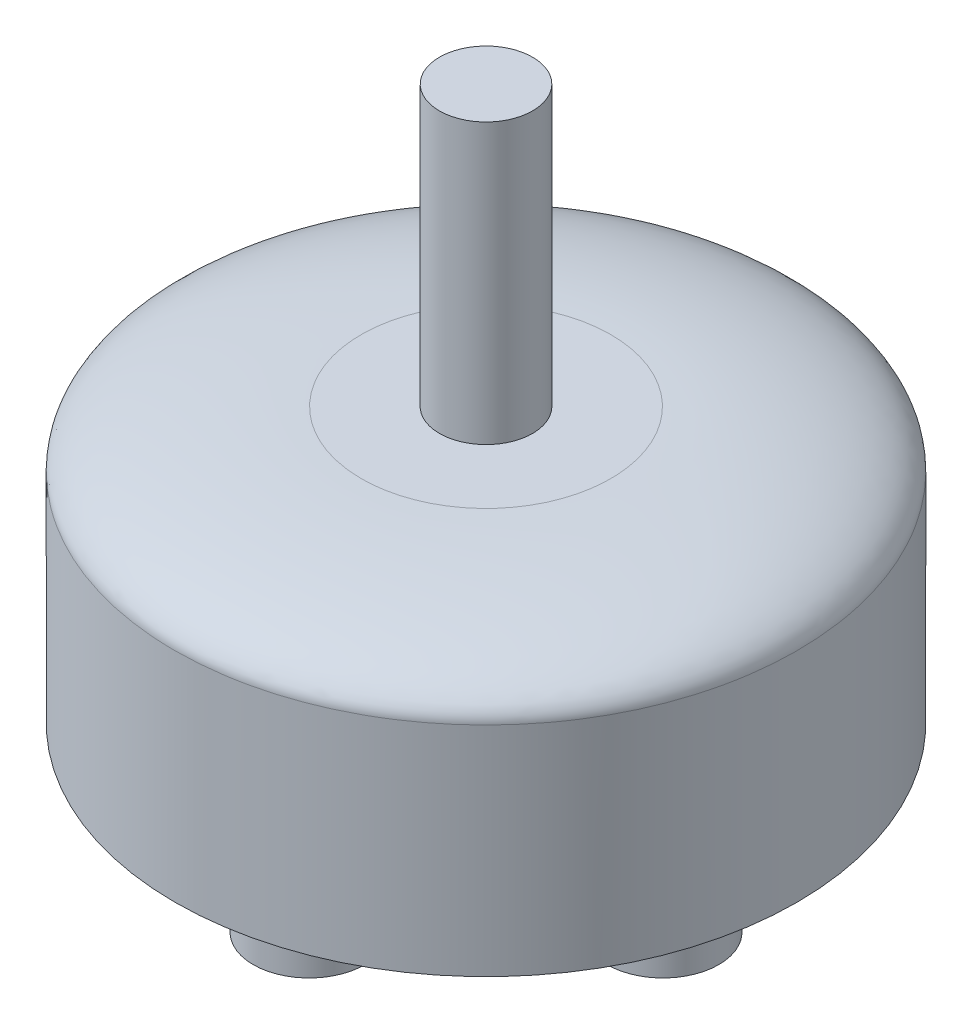
ISO-10303-21;
HEADER;
FILE_DESCRIPTION(('STEP AP214'),'2;1');
FILE_NAME('part.step','',(''),(''),'','','');
FILE_SCHEMA(('AUTOMOTIVE_DESIGN { 1 0 10303 214 1 1 1 1 }'));
ENDSEC;
DATA;
#1=APPLICATION_CONTEXT('core data for automotive mechanical design processes');
#2=APPLICATION_PROTOCOL_DEFINITION('international standard','automotive_design',2000,#1);
#3=PRODUCT_CONTEXT('',#1,'mechanical');
#4=PRODUCT('Part','Part','',(#3));
#5=PRODUCT_RELATED_PRODUCT_CATEGORY('part','',(#4));
#6=PRODUCT_DEFINITION_FORMATION('','',#4);
#7=PRODUCT_DEFINITION_CONTEXT('part definition',#1,'design');
#8=PRODUCT_DEFINITION('design','',#6,#7);
#9=PRODUCT_DEFINITION_SHAPE('','',#8);
#10=(LENGTH_UNIT() NAMED_UNIT(*) SI_UNIT(.MILLI.,.METRE.));
#11=(NAMED_UNIT(*) PLANE_ANGLE_UNIT() SI_UNIT($,.RADIAN.));
#12=(NAMED_UNIT(*) SI_UNIT($,.STERADIAN.) SOLID_ANGLE_UNIT());
#13=UNCERTAINTY_MEASURE_WITH_UNIT(LENGTH_MEASURE(1.E-05),#10,'distance_accuracy_value','');
#14=(GEOMETRIC_REPRESENTATION_CONTEXT(3) GLOBAL_UNCERTAINTY_ASSIGNED_CONTEXT((#13)) GLOBAL_UNIT_ASSIGNED_CONTEXT((#10,
#11,#12)) REPRESENTATION_CONTEXT('',''));
#15=CARTESIAN_POINT('',(0.,0.,0.));
#16=DIRECTION('',(0.,0.,1.));
#17=DIRECTION('',(1.,0.,0.));
#18=AXIS2_PLACEMENT_3D('',#15,#16,#17);
#19=CARTESIAN_POINT('',(-4.74999999999986,3.,1.34135758056431E-13));
#20=DIRECTION('',(0.,1.,0.));
#21=DIRECTION('',(0.,0.,1.));
#22=AXIS2_PLACEMENT_3D('',#19,#20,#21);
#23=PLANE('',#22);
#24=CARTESIAN_POINT('',(0.,3.,9.5));
#25=DIRECTION('',(0.,1.,0.));
#26=DIRECTION('',(0.,0.,1.));
#27=AXIS2_PLACEMENT_3D('',#24,#25,#26);
#28=CIRCLE('',#27,1.50000000000077);
#29=CARTESIAN_POINT('',(0.,3.,11.0000000000008));
#30=VERTEX_POINT('',#29);
#31=EDGE_CURVE('E259',#30,#30,#28,.T.);
#32=ORIENTED_EDGE('',*,*,#31,.F.);
#33=EDGE_LOOP('',(#32));
#34=FACE_BOUND('',#33,.T.);
#35=CARTESIAN_POINT('',(0.,3.,-9.5));
#36=DIRECTION('',(0.,1.,0.));
#37=DIRECTION('',(0.,0.,1.));
#38=AXIS2_PLACEMENT_3D('',#35,#36,#37);
#39=CIRCLE('',#38,1.5);
#40=CARTESIAN_POINT('',(0.,3.,-8.));
#41=VERTEX_POINT('',#40);
#42=EDGE_CURVE('E149',#41,#41,#39,.T.);
#43=ORIENTED_EDGE('',*,*,#42,.F.);
#44=EDGE_LOOP('',(#43));
#45=FACE_BOUND('',#44,.T.);
#46=CARTESIAN_POINT('',(0.,3.,0.));
#47=DIRECTION('',(0.,1.,0.));
#48=DIRECTION('',(0.,0.,1.));
#49=AXIS2_PLACEMENT_3D('',#46,#47,#48);
#50=CIRCLE('',#49,9.5);
#51=CARTESIAN_POINT('',(-2.96236784830953,3.,-9.02631578947369));
#52=VERTEX_POINT('',#51);
#53=CARTESIAN_POINT('',(-9.02631578947375,3.,-2.96236784830932));
#54=VERTEX_POINT('',#53);
#55=EDGE_CURVE('E160',#52,#54,#50,.T.);
#56=ORIENTED_EDGE('',*,*,#55,.T.);
#57=CARTESIAN_POINT('',(-9.49999999999973,3.,2.68271516112861E-13));
#58=DIRECTION('',(0.,1.,0.));
#59=DIRECTION('',(0.,0.,1.));
#60=AXIS2_PLACEMENT_3D('',#57,#58,#59);
#61=CIRCLE('',#60,3.);
#62=CARTESIAN_POINT('',(-9.02631578947359,3.,2.96236784830983));
#63=VERTEX_POINT('',#62);
#64=EDGE_CURVE('E108',#54,#63,#61,.T.);
#65=ORIENTED_EDGE('',*,*,#64,.T.);
#66=CARTESIAN_POINT('',(0.,3.,0.));
#67=DIRECTION('',(0.,1.,0.));
#68=DIRECTION('',(0.,0.,1.));
#69=AXIS2_PLACEMENT_3D('',#66,#67,#68);
#70=CIRCLE('',#69,9.5);
#71=CARTESIAN_POINT('',(-2.96236784830903,3.,9.02631578947385));
#72=VERTEX_POINT('',#71);
#73=EDGE_CURVE('E277',#63,#72,#70,.T.);
#74=ORIENTED_EDGE('',*,*,#73,.T.);
#75=CARTESIAN_POINT('',(5.37685650259296E-13,3.,9.5));
#76=DIRECTION('',(0.,1.,0.));
#77=DIRECTION('',(0.,0.,1.));
#78=AXIS2_PLACEMENT_3D('',#75,#76,#77);
#79=CIRCLE('',#78,3.);
#80=CARTESIAN_POINT('',(2.96236784831005,3.,9.02631578947351));
#81=VERTEX_POINT('',#80);
#82=EDGE_CURVE('E279',#72,#81,#79,.T.);
#83=ORIENTED_EDGE('',*,*,#82,.T.);
#84=CARTESIAN_POINT('',(0.,3.,0.));
#85=DIRECTION('',(0.,1.,0.));
#86=DIRECTION('',(0.,0.,1.));
#87=AXIS2_PLACEMENT_3D('',#84,#85,#86);
#88=CIRCLE('',#87,9.5);
#89=CARTESIAN_POINT('',(9.02631578947371,3.,2.96236784830944));
#90=VERTEX_POINT('',#89);
#91=EDGE_CURVE('E127',#81,#90,#88,.T.);
#92=ORIENTED_EDGE('',*,*,#91,.T.);
#93=CARTESIAN_POINT('',(9.50000000000026,3.,-2.70577548605625E-13));
#94=DIRECTION('',(0.,1.,0.));
#95=DIRECTION('',(0.,0.,1.));
#96=AXIS2_PLACEMENT_3D('',#93,#94,#95);
#97=CIRCLE('',#96,3.00000000000021);
#98=CARTESIAN_POINT('',(9.02631578947354,3.,-2.96236784830996));
#99=VERTEX_POINT('',#98);
#100=EDGE_CURVE('E121',#90,#99,#97,.T.);
#101=ORIENTED_EDGE('',*,*,#100,.T.);
#102=CARTESIAN_POINT('',(0.,3.,0.));
#103=DIRECTION('',(0.,1.,0.));
#104=DIRECTION('',(0.,0.,1.));
#105=AXIS2_PLACEMENT_3D('',#102,#103,#104);
#106=CIRCLE('',#105,9.5);
#107=CARTESIAN_POINT('',(2.96236784830953,3.,-9.02631578947368));
#108=VERTEX_POINT('',#107);
#109=EDGE_CURVE('E125',#99,#108,#106,.T.);
#110=ORIENTED_EDGE('',*,*,#109,.T.);
#111=CARTESIAN_POINT('',(0.,3.,-9.5));
#112=DIRECTION('',(0.,1.,0.));
#113=DIRECTION('',(0.,0.,1.));
#114=AXIS2_PLACEMENT_3D('',#111,#112,#113);
#115=CIRCLE('',#114,3.);
#116=EDGE_CURVE('E64',#108,#52,#115,.T.);
#117=ORIENTED_EDGE('',*,*,#116,.T.);
#118=EDGE_LOOP('',(#56,#65,#74,#83,#92,#101,#110,#117));
#119=FACE_BOUND('',#118,.T.);
#120=CARTESIAN_POINT('',(9.5,3.,0.));
#121=DIRECTION('',(0.,1.,0.));
#122=DIRECTION('',(0.,0.,1.));
#123=AXIS2_PLACEMENT_3D('',#120,#121,#122);
#124=CIRCLE('',#123,1.5000000000005);
#125=CARTESIAN_POINT('',(9.5,3.,1.5000000000005));
#126=VERTEX_POINT('',#125);
#127=EDGE_CURVE('E265',#126,#126,#124,.T.);
#128=ORIENTED_EDGE('',*,*,#127,.F.);
#129=EDGE_LOOP('',(#128));
#130=FACE_BOUND('',#129,.T.);
#131=CARTESIAN_POINT('',(-9.5,3.,0.));
#132=DIRECTION('',(0.,1.,0.));
#133=DIRECTION('',(0.,0.,1.));
#134=AXIS2_PLACEMENT_3D('',#131,#132,#133);
#135=CIRCLE('',#134,1.50000000000027);
#136=CARTESIAN_POINT('',(-9.5,3.,1.50000000000027));
#137=VERTEX_POINT('',#136);
#138=EDGE_CURVE('E253',#137,#137,#135,.T.);
#139=ORIENTED_EDGE('',*,*,#138,.F.);
#140=EDGE_LOOP('',(#139));
#141=FACE_BOUND('',#140,.T.);
#142=CARTESIAN_POINT('',(0.,3.,0.));
#143=DIRECTION('',(0.,1.,0.));
#144=DIRECTION('',(0.,0.,1.));
#145=AXIS2_PLACEMENT_3D('',#142,#143,#144);
#146=CIRCLE('',#145,7.);
#147=CARTESIAN_POINT('',(0.,3.,7.));
#148=VERTEX_POINT('',#147);
#149=EDGE_CURVE('E237',#148,#148,#146,.T.);
#150=ORIENTED_EDGE('',*,*,#149,.F.);
#151=EDGE_LOOP('',(#150));
#152=FACE_BOUND('',#151,.T.);
#153=ADVANCED_FACE('F41',(#34,#45,#119,#130,#141,#152),#23,.T.);
#154=CARTESIAN_POINT('',(-4.74999999999986,0.,1.34135758056431E-13));
#155=DIRECTION('',(0.,1.,0.));
#156=DIRECTION('',(0.,0.,1.));
#157=AXIS2_PLACEMENT_3D('',#154,#155,#156);
#158=PLANE('',#157);
#159=CARTESIAN_POINT('',(0.,0.,0.));
#160=DIRECTION('',(0.,1.,0.));
#161=DIRECTION('',(0.,0.,1.));
#162=AXIS2_PLACEMENT_3D('',#159,#160,#161);
#163=CIRCLE('',#162,9.5);
#164=CARTESIAN_POINT('',(-2.96236784830953,0.,-9.02631578947369));
#165=VERTEX_POINT('',#164);
#166=CARTESIAN_POINT('',(-9.02631578947375,0.,-2.96236784830932));
#167=VERTEX_POINT('',#166);
#168=EDGE_CURVE('E145',#165,#167,#163,.T.);
#169=ORIENTED_EDGE('',*,*,#168,.F.);
#170=CARTESIAN_POINT('',(0.,0.,-9.5));
#171=DIRECTION('',(0.,1.,0.));
#172=DIRECTION('',(0.,0.,1.));
#173=AXIS2_PLACEMENT_3D('',#170,#171,#172);
#174=CIRCLE('',#173,3.);
#175=CARTESIAN_POINT('',(2.96236784830953,0.,-9.02631578947368));
#176=VERTEX_POINT('',#175);
#177=EDGE_CURVE('E99',#176,#165,#174,.T.);
#178=ORIENTED_EDGE('',*,*,#177,.F.);
#179=CARTESIAN_POINT('',(0.,0.,0.));
#180=DIRECTION('',(0.,1.,0.));
#181=DIRECTION('',(0.,0.,1.));
#182=AXIS2_PLACEMENT_3D('',#179,#180,#181);
#183=CIRCLE('',#182,9.5);
#184=CARTESIAN_POINT('',(9.02631578947354,0.,-2.96236784830996));
#185=VERTEX_POINT('',#184);
#186=EDGE_CURVE('E93',#185,#176,#183,.T.);
#187=ORIENTED_EDGE('',*,*,#186,.F.);
#188=CARTESIAN_POINT('',(9.50000000000026,0.,-2.70577548605625E-13));
#189=DIRECTION('',(0.,1.,0.));
#190=DIRECTION('',(0.,0.,1.));
#191=AXIS2_PLACEMENT_3D('',#188,#189,#190);
#192=CIRCLE('',#191,3.00000000000021);
#193=CARTESIAN_POINT('',(9.02631578947371,0.,2.96236784830944));
#194=VERTEX_POINT('',#193);
#195=EDGE_CURVE('E135',#194,#185,#192,.T.);
#196=ORIENTED_EDGE('',*,*,#195,.F.);
#197=CARTESIAN_POINT('',(0.,0.,0.));
#198=DIRECTION('',(0.,1.,0.));
#199=DIRECTION('',(0.,0.,1.));
#200=AXIS2_PLACEMENT_3D('',#197,#198,#199);
#201=CIRCLE('',#200,9.5);
#202=CARTESIAN_POINT('',(2.96236784831005,0.,9.02631578947351));
#203=VERTEX_POINT('',#202);
#204=EDGE_CURVE('E155',#203,#194,#201,.T.);
#205=ORIENTED_EDGE('',*,*,#204,.F.);
#206=CARTESIAN_POINT('',(5.37685650259296E-13,0.,9.5));
#207=DIRECTION('',(0.,1.,0.));
#208=DIRECTION('',(0.,0.,1.));
#209=AXIS2_PLACEMENT_3D('',#206,#207,#208);
#210=CIRCLE('',#209,3.);
#211=CARTESIAN_POINT('',(-2.96236784830903,0.,9.02631578947385));
#212=VERTEX_POINT('',#211);
#213=EDGE_CURVE('E153',#212,#203,#210,.T.);
#214=ORIENTED_EDGE('',*,*,#213,.F.);
#215=CARTESIAN_POINT('',(0.,0.,0.));
#216=DIRECTION('',(0.,1.,0.));
#217=DIRECTION('',(0.,0.,1.));
#218=AXIS2_PLACEMENT_3D('',#215,#216,#217);
#219=CIRCLE('',#218,9.5);
#220=CARTESIAN_POINT('',(-9.02631578947359,0.,2.96236784830983));
#221=VERTEX_POINT('',#220);
#222=EDGE_CURVE('E151',#221,#212,#219,.T.);
#223=ORIENTED_EDGE('',*,*,#222,.F.);
#224=CARTESIAN_POINT('',(-9.49999999999973,0.,2.68271516112861E-13));
#225=DIRECTION('',(0.,1.,0.));
#226=DIRECTION('',(0.,0.,1.));
#227=AXIS2_PLACEMENT_3D('',#224,#225,#226);
#228=CIRCLE('',#227,3.);
#229=EDGE_CURVE('E148',#167,#221,#228,.T.);
#230=ORIENTED_EDGE('',*,*,#229,.F.);
#231=EDGE_LOOP('',(#169,#178,#187,#196,#205,#214,#223,#230));
#232=FACE_BOUND('',#231,.T.);
#233=CARTESIAN_POINT('',(0.,0.,-9.5));
#234=DIRECTION('',(0.,1.,0.));
#235=DIRECTION('',(0.,0.,1.));
#236=AXIS2_PLACEMENT_3D('',#233,#234,#235);
#237=CIRCLE('',#236,1.5);
#238=CARTESIAN_POINT('',(0.,0.,-8.));
#239=VERTEX_POINT('',#238);
#240=EDGE_CURVE('E268',#239,#239,#237,.T.);
#241=ORIENTED_EDGE('',*,*,#240,.T.);
#242=EDGE_LOOP('',(#241));
#243=FACE_BOUND('',#242,.T.);
#244=CARTESIAN_POINT('',(9.5,0.,0.));
#245=DIRECTION('',(0.,1.,0.));
#246=DIRECTION('',(0.,0.,1.));
#247=AXIS2_PLACEMENT_3D('',#244,#245,#246);
#248=CIRCLE('',#247,1.5000000000005);
#249=CARTESIAN_POINT('',(9.5,0.,1.5000000000005));
#250=VERTEX_POINT('',#249);
#251=EDGE_CURVE('E262',#250,#250,#248,.T.);
#252=ORIENTED_EDGE('',*,*,#251,.T.);
#253=EDGE_LOOP('',(#252));
#254=FACE_BOUND('',#253,.T.);
#255=CARTESIAN_POINT('',(0.,0.,9.5));
#256=DIRECTION('',(0.,1.,0.));
#257=DIRECTION('',(0.,0.,1.));
#258=AXIS2_PLACEMENT_3D('',#255,#256,#257);
#259=CIRCLE('',#258,1.50000000000077);
#260=CARTESIAN_POINT('',(0.,0.,11.0000000000008));
#261=VERTEX_POINT('',#260);
#262=EDGE_CURVE('E256',#261,#261,#259,.T.);
#263=ORIENTED_EDGE('',*,*,#262,.T.);
#264=EDGE_LOOP('',(#263));
#265=FACE_BOUND('',#264,.T.);
#266=CARTESIAN_POINT('',(-9.5,0.,0.));
#267=DIRECTION('',(0.,1.,0.));
#268=DIRECTION('',(0.,0.,1.));
#269=AXIS2_PLACEMENT_3D('',#266,#267,#268);
#270=CIRCLE('',#269,1.50000000000027);
#271=CARTESIAN_POINT('',(-9.5,0.,1.50000000000027));
#272=VERTEX_POINT('',#271);
#273=EDGE_CURVE('E252',#272,#272,#270,.T.);
#274=ORIENTED_EDGE('',*,*,#273,.T.);
#275=EDGE_LOOP('',(#274));
#276=FACE_BOUND('',#275,.T.);
#277=CARTESIAN_POINT('',(0.,0.,0.));
#278=DIRECTION('',(0.,1.,0.));
#279=DIRECTION('',(0.,0.,1.));
#280=AXIS2_PLACEMENT_3D('',#277,#278,#279);
#281=CIRCLE('',#280,4.5);
#282=CARTESIAN_POINT('',(0.,0.,4.5));
#283=VERTEX_POINT('',#282);
#284=EDGE_CURVE('E247',#283,#283,#281,.T.);
#285=ORIENTED_EDGE('',*,*,#284,.T.);
#286=EDGE_LOOP('',(#285));
#287=FACE_BOUND('',#286,.T.);
#288=ADVANCED_FACE('F292',(#232,#243,#254,#265,#276,#287),#158,.F.);
#289=CARTESIAN_POINT('',(0.,3.,0.));
#290=DIRECTION('',(0.,-1.,0.));
#291=DIRECTION('',(0.,0.,-1.));
#292=AXIS2_PLACEMENT_3D('',#289,#290,#291);
#293=CYLINDRICAL_SURFACE('',#292,9.5);
#294=ORIENTED_EDGE('',*,*,#168,.T.);
#295=DIRECTION('',(0.,-1.,0.));
#296=VECTOR('',#295,1.);
#297=CARTESIAN_POINT('',(-9.02631578947375,3.,-2.96236784830932));
#298=LINE('',#297,#296);
#299=EDGE_CURVE('E173',#54,#167,#298,.T.);
#300=ORIENTED_EDGE('',*,*,#299,.F.);
#301=ORIENTED_EDGE('',*,*,#55,.F.);
#302=DIRECTION('',(0.,-1.,0.));
#303=VECTOR('',#302,1.);
#304=CARTESIAN_POINT('',(-2.96236784830953,3.,-9.02631578947369));
#305=LINE('',#304,#303);
#306=EDGE_CURVE('E141',#52,#165,#305,.T.);
#307=ORIENTED_EDGE('',*,*,#306,.T.);
#308=EDGE_LOOP('',(#294,#300,#301,#307));
#309=FACE_BOUND('',#308,.T.);
#310=ADVANCED_FACE('F297',(#309),#293,.T.);
#311=CARTESIAN_POINT('',(-9.49999999999973,3.,2.68271516112861E-13));
#312=DIRECTION('',(0.,-1.,0.));
#313=DIRECTION('',(0.,0.,-1.));
#314=AXIS2_PLACEMENT_3D('',#311,#312,#313);
#315=CYLINDRICAL_SURFACE('',#314,3.);
#316=ORIENTED_EDGE('',*,*,#229,.T.);
#317=DIRECTION('',(0.,-1.,0.));
#318=VECTOR('',#317,1.);
#319=CARTESIAN_POINT('',(-9.02631578947359,3.,2.96236784830983));
#320=LINE('',#319,#318);
#321=EDGE_CURVE('E170',#63,#221,#320,.T.);
#322=ORIENTED_EDGE('',*,*,#321,.F.);
#323=ORIENTED_EDGE('',*,*,#64,.F.);
#324=ORIENTED_EDGE('',*,*,#299,.T.);
#325=EDGE_LOOP('',(#316,#322,#323,#324));
#326=FACE_BOUND('',#325,.T.);
#327=ADVANCED_FACE('F398',(#326),#315,.T.);
#328=CARTESIAN_POINT('',(0.,3.,0.));
#329=DIRECTION('',(0.,-1.,0.));
#330=DIRECTION('',(0.,0.,-1.));
#331=AXIS2_PLACEMENT_3D('',#328,#329,#330);
#332=CYLINDRICAL_SURFACE('',#331,9.5);
#333=ORIENTED_EDGE('',*,*,#222,.T.);
#334=DIRECTION('',(0.,-1.,0.));
#335=VECTOR('',#334,1.);
#336=CARTESIAN_POINT('',(-2.96236784830903,3.,9.02631578947385));
#337=LINE('',#336,#335);
#338=EDGE_CURVE('E167',#72,#212,#337,.T.);
#339=ORIENTED_EDGE('',*,*,#338,.F.);
#340=ORIENTED_EDGE('',*,*,#73,.F.);
#341=ORIENTED_EDGE('',*,*,#321,.T.);
#342=EDGE_LOOP('',(#333,#339,#340,#341));
#343=FACE_BOUND('',#342,.T.);
#344=ADVANCED_FACE('F406',(#343),#332,.T.);
#345=CARTESIAN_POINT('',(5.37685650259296E-13,3.,9.5));
#346=DIRECTION('',(0.,-1.,0.));
#347=DIRECTION('',(0.,0.,-1.));
#348=AXIS2_PLACEMENT_3D('',#345,#346,#347);
#349=CYLINDRICAL_SURFACE('',#348,3.);
#350=ORIENTED_EDGE('',*,*,#213,.T.);
#351=DIRECTION('',(0.,-1.,0.));
#352=VECTOR('',#351,1.);
#353=CARTESIAN_POINT('',(2.96236784831005,3.,9.02631578947351));
#354=LINE('',#353,#352);
#355=EDGE_CURVE('E164',#81,#203,#354,.T.);
#356=ORIENTED_EDGE('',*,*,#355,.F.);
#357=ORIENTED_EDGE('',*,*,#82,.F.);
#358=ORIENTED_EDGE('',*,*,#338,.T.);
#359=EDGE_LOOP('',(#350,#356,#357,#358));
#360=FACE_BOUND('',#359,.T.);
#361=ADVANCED_FACE('F285',(#360),#349,.T.);
#362=CARTESIAN_POINT('',(0.,3.,0.));
#363=DIRECTION('',(0.,-1.,0.));
#364=DIRECTION('',(0.,0.,-1.));
#365=AXIS2_PLACEMENT_3D('',#362,#363,#364);
#366=CYLINDRICAL_SURFACE('',#365,9.5);
#367=ORIENTED_EDGE('',*,*,#204,.T.);
#368=DIRECTION('',(0.,-1.,0.));
#369=VECTOR('',#368,1.);
#370=CARTESIAN_POINT('',(9.02631578947371,3.,2.96236784830944));
#371=LINE('',#370,#369);
#372=EDGE_CURVE('E136',#90,#194,#371,.T.);
#373=ORIENTED_EDGE('',*,*,#372,.F.);
#374=ORIENTED_EDGE('',*,*,#91,.F.);
#375=ORIENTED_EDGE('',*,*,#355,.T.);
#376=EDGE_LOOP('',(#367,#373,#374,#375));
#377=FACE_BOUND('',#376,.T.);
#378=ADVANCED_FACE('F289',(#377),#366,.T.);
#379=CARTESIAN_POINT('',(9.50000000000026,3.,-2.70577548605625E-13));
#380=DIRECTION('',(0.,-1.,0.));
#381=DIRECTION('',(0.,0.,-1.));
#382=AXIS2_PLACEMENT_3D('',#379,#380,#381);
#383=CYLINDRICAL_SURFACE('',#382,3.00000000000021);
#384=ORIENTED_EDGE('',*,*,#195,.T.);
#385=DIRECTION('',(0.,-1.,0.));
#386=VECTOR('',#385,1.);
#387=CARTESIAN_POINT('',(9.02631578947354,3.,-2.96236784830996));
#388=LINE('',#387,#386);
#389=EDGE_CURVE('E132',#99,#185,#388,.T.);
#390=ORIENTED_EDGE('',*,*,#389,.F.);
#391=ORIENTED_EDGE('',*,*,#100,.F.);
#392=ORIENTED_EDGE('',*,*,#372,.T.);
#393=EDGE_LOOP('',(#384,#390,#391,#392));
#394=FACE_BOUND('',#393,.T.);
#395=ADVANCED_FACE('F133',(#394),#383,.T.);
#396=CARTESIAN_POINT('',(0.,3.,0.));
#397=DIRECTION('',(0.,-1.,0.));
#398=DIRECTION('',(0.,0.,-1.));
#399=AXIS2_PLACEMENT_3D('',#396,#397,#398);
#400=CYLINDRICAL_SURFACE('',#399,9.5);
#401=ORIENTED_EDGE('',*,*,#186,.T.);
#402=DIRECTION('',(0.,-1.,0.));
#403=VECTOR('',#402,1.);
#404=CARTESIAN_POINT('',(2.96236784830953,3.,-9.02631578947368));
#405=LINE('',#404,#403);
#406=EDGE_CURVE('E137',#108,#176,#405,.T.);
#407=ORIENTED_EDGE('',*,*,#406,.F.);
#408=ORIENTED_EDGE('',*,*,#109,.F.);
#409=ORIENTED_EDGE('',*,*,#389,.T.);
#410=EDGE_LOOP('',(#401,#407,#408,#409));
#411=FACE_BOUND('',#410,.T.);
#412=ADVANCED_FACE('F139',(#411),#400,.T.);
#413=CARTESIAN_POINT('',(0.,3.,-9.5));
#414=DIRECTION('',(0.,-1.,0.));
#415=DIRECTION('',(0.,0.,-1.));
#416=AXIS2_PLACEMENT_3D('',#413,#414,#415);
#417=CYLINDRICAL_SURFACE('',#416,3.);
#418=ORIENTED_EDGE('',*,*,#177,.T.);
#419=ORIENTED_EDGE('',*,*,#306,.F.);
#420=ORIENTED_EDGE('',*,*,#116,.F.);
#421=ORIENTED_EDGE('',*,*,#406,.T.);
#422=EDGE_LOOP('',(#418,#419,#420,#421));
#423=FACE_BOUND('',#422,.T.);
#424=ADVANCED_FACE('F299',(#423),#417,.T.);
#425=CARTESIAN_POINT('',(0.,3.,-9.5));
#426=DIRECTION('',(0.,-1.,0.));
#427=DIRECTION('',(0.,0.,-1.));
#428=AXIS2_PLACEMENT_3D('',#425,#426,#427);
#429=CYLINDRICAL_SURFACE('',#428,1.5);
#430=ORIENTED_EDGE('',*,*,#42,.T.);
#431=EDGE_LOOP('',(#430));
#432=FACE_BOUND('',#431,.T.);
#433=ORIENTED_EDGE('',*,*,#240,.F.);
#434=EDGE_LOOP('',(#433));
#435=FACE_BOUND('',#434,.T.);
#436=ADVANCED_FACE('F301',(#432,#435),#429,.F.);
#437=CARTESIAN_POINT('',(9.5,3.,0.));
#438=DIRECTION('',(0.,-1.,0.));
#439=DIRECTION('',(0.,0.,-1.));
#440=AXIS2_PLACEMENT_3D('',#437,#438,#439);
#441=CYLINDRICAL_SURFACE('',#440,1.5000000000005);
#442=ORIENTED_EDGE('',*,*,#127,.T.);
#443=EDGE_LOOP('',(#442));
#444=FACE_BOUND('',#443,.T.);
#445=ORIENTED_EDGE('',*,*,#251,.F.);
#446=EDGE_LOOP('',(#445));
#447=FACE_BOUND('',#446,.T.);
#448=ADVANCED_FACE('F307',(#444,#447),#441,.F.);
#449=CARTESIAN_POINT('',(0.,3.,9.5));
#450=DIRECTION('',(0.,-1.,0.));
#451=DIRECTION('',(0.,0.,-1.));
#452=AXIS2_PLACEMENT_3D('',#449,#450,#451);
#453=CYLINDRICAL_SURFACE('',#452,1.50000000000077);
#454=ORIENTED_EDGE('',*,*,#31,.T.);
#455=EDGE_LOOP('',(#454));
#456=FACE_BOUND('',#455,.T.);
#457=ORIENTED_EDGE('',*,*,#262,.F.);
#458=EDGE_LOOP('',(#457));
#459=FACE_BOUND('',#458,.T.);
#460=ADVANCED_FACE('F323',(#456,#459),#453,.F.);
#461=CARTESIAN_POINT('',(-9.5,3.,0.));
#462=DIRECTION('',(0.,-1.,0.));
#463=DIRECTION('',(0.,0.,-1.));
#464=AXIS2_PLACEMENT_3D('',#461,#462,#463);
#465=CYLINDRICAL_SURFACE('',#464,1.50000000000027);
#466=ORIENTED_EDGE('',*,*,#138,.T.);
#467=EDGE_LOOP('',(#466));
#468=FACE_BOUND('',#467,.T.);
#469=ORIENTED_EDGE('',*,*,#273,.F.);
#470=EDGE_LOOP('',(#469));
#471=FACE_BOUND('',#470,.T.);
#472=ADVANCED_FACE('F327',(#468,#471),#465,.F.);
#473=CARTESIAN_POINT('',(0.,3.,0.));
#474=DIRECTION('',(0.,-1.,0.));
#475=DIRECTION('',(0.,0.,-1.));
#476=AXIS2_PLACEMENT_3D('',#473,#474,#475);
#477=CYLINDRICAL_SURFACE('',#476,4.5);
#478=ORIENTED_EDGE('',*,*,#284,.F.);
#479=EDGE_LOOP('',(#478));
#480=FACE_BOUND('',#479,.T.);
#481=CARTESIAN_POINT('',(0.,5.,0.));
#482=DIRECTION('',(0.,1.,0.));
#483=DIRECTION('',(0.,0.,1.));
#484=AXIS2_PLACEMENT_3D('',#481,#482,#483);
#485=CIRCLE('',#484,4.5);
#486=CARTESIAN_POINT('',(0.,5.,4.5));
#487=VERTEX_POINT('',#486);
#488=EDGE_CURVE('E233',#487,#487,#485,.T.);
#489=ORIENTED_EDGE('',*,*,#488,.T.);
#490=EDGE_LOOP('',(#489));
#491=FACE_BOUND('',#490,.T.);
#492=ADVANCED_FACE('F330',(#480,#491),#477,.F.);
#493=CARTESIAN_POINT('',(0.,5.,0.));
#494=DIRECTION('',(0.,-1.,0.));
#495=DIRECTION('',(0.,0.,-1.));
#496=AXIS2_PLACEMENT_3D('',#493,#494,#495);
#497=CYLINDRICAL_SURFACE('',#496,7.);
#498=CARTESIAN_POINT('',(0.,5.,0.));
#499=DIRECTION('',(0.,1.,0.));
#500=DIRECTION('',(0.,0.,1.));
#501=AXIS2_PLACEMENT_3D('',#498,#499,#500);
#502=CIRCLE('',#501,7.);
#503=CARTESIAN_POINT('',(0.,5.,7.));
#504=VERTEX_POINT('',#503);
#505=EDGE_CURVE('E244',#504,#504,#502,.T.);
#506=ORIENTED_EDGE('',*,*,#505,.F.);
#507=EDGE_LOOP('',(#506));
#508=FACE_BOUND('',#507,.T.);
#509=ORIENTED_EDGE('',*,*,#149,.T.);
#510=EDGE_LOOP('',(#509));
#511=FACE_BOUND('',#510,.T.);
#512=ADVANCED_FACE('F207',(#508,#511),#497,.T.);
#513=CARTESIAN_POINT('',(0.,5.,0.));
#514=DIRECTION('',(0.,1.,0.));
#515=DIRECTION('',(0.,0.,1.));
#516=AXIS2_PLACEMENT_3D('',#513,#514,#515);
#517=PLANE('',#516);
#518=ORIENTED_EDGE('',*,*,#488,.F.);
#519=EDGE_LOOP('',(#518));
#520=FACE_BOUND('',#519,.T.);
#521=ADVANCED_FACE('F202',(#520),#517,.F.);
#522=CARTESIAN_POINT('',(0.,19.7,0.));
#523=DIRECTION('',(0.,-1.,0.));
#524=DIRECTION('',(0.,0.,-1.));
#525=AXIS2_PLACEMENT_3D('',#522,#523,#524);
#526=CYLINDRICAL_SURFACE('',#525,16.7);
#527=CARTESIAN_POINT('',(0.,16.7,16.7));
#528=CARTESIAN_POINT('',(2.1860248800064,16.7,16.7));
#529=CARTESIAN_POINT('',(4.37118967629864,16.7,16.2653436972548));
#530=CARTESIAN_POINT('',(8.41043696469535,16.7,14.5922326886222));
#531=CARTESIAN_POINT('',(10.262930229321,16.7,13.3544362623097));
#532=CARTESIAN_POINT('',(13.3544362623097,16.7,10.262930229321));
#533=CARTESIAN_POINT('',(14.592232688622,16.7,8.41043696469572));
#534=CARTESIAN_POINT('',(16.265343697255,16.7,4.37118967629827));
#535=CARTESIAN_POINT('',(16.7,16.7,2.18602488000667));
#536=CARTESIAN_POINT('',(16.7,16.7,-2.18602488000667));
#537=CARTESIAN_POINT('',(16.2653436972551,16.7,-4.37118967629796));
#538=CARTESIAN_POINT('',(14.5922326886219,16.7,-8.41043696469606));
#539=CARTESIAN_POINT('',(13.3544362623116,16.7,-10.2629302293191));
#540=CARTESIAN_POINT('',(10.2629302293191,16.7,-13.3544362623116));
#541=CARTESIAN_POINT('',(8.41043696469588,16.7,-14.5922326886219));
#542=CARTESIAN_POINT('',(4.37118967629817,16.7,-16.265343697255));
#543=CARTESIAN_POINT('',(2.18602488000667,16.7,-16.7));
#544=CARTESIAN_POINT('',(-2.18602488000667,16.7,-16.7));
#545=CARTESIAN_POINT('',(-4.37118967629839,16.7,-16.2653436972549));
#546=CARTESIAN_POINT('',(-8.41043696469557,16.7,-14.5922326886221));
#547=CARTESIAN_POINT('',(-10.2629302293199,16.7,-13.3544362623108));
#548=CARTESIAN_POINT('',(-13.3544362623108,16.7,-10.2629302293199));
#549=CARTESIAN_POINT('',(-14.5922326886219,16.7,-8.41043696469594));
#550=CARTESIAN_POINT('',(-16.2653436972551,16.7,-4.3711896762981));
#551=CARTESIAN_POINT('',(-16.7,16.7,-2.18602488000665));
#552=CARTESIAN_POINT('',(-16.7,16.7,2.1860248800067));
#553=CARTESIAN_POINT('',(-16.2653436972549,16.7,4.37118967629832));
#554=CARTESIAN_POINT('',(-14.592232688622,16.7,8.41043696469563));
#555=CARTESIAN_POINT('',(-13.3544362623101,16.7,10.2629302293206));
#556=CARTESIAN_POINT('',(-10.2629302293206,16.7,13.35443626231));
#557=CARTESIAN_POINT('',(-8.41043696469545,16.7,14.5922326886221));
#558=CARTESIAN_POINT('',(-4.37118967629859,16.7,16.2653436972548));
#559=CARTESIAN_POINT('',(-2.1860248800064,16.7,16.7));
#560=CARTESIAN_POINT('',(0.,16.7,16.7));
#561=(BOUNDED_CURVE() B_SPLINE_CURVE(3,(#527,#528,#529,#530,#531,#532,#533,#534,#535,#536,#537,
#538,#539,#540,#541,#542,#543,#544,#545,#546,#547,#548,#549,#550,#551,#552,#553,#554,#555,#556,
#557,#558,#559,#560),.UNSPECIFIED.,.T.,.F.) B_SPLINE_CURVE_WITH_KNOTS((4,2,2,2,2,2,2,2,2,2,2,2,
2,2,2,2,4),(0.,0.392699081698724,0.785398163397448,1.17809724509617,1.5707963267949,
1.96349540849362,2.35619449019234,2.74889357189107,3.14159265358979,3.53429173528852,
3.92699081698724,4.31968989868597,4.71238898038469,5.10508806208341,5.49778714378214,
5.89048622548086,6.28318530717959),
.UNSPECIFIED.) CURVE() GEOMETRIC_REPRESENTATION_ITEM() RATIONAL_B_SPLINE_CURVE((1.,1.,1.,1.,1.,
1.,1.,1.,1.,1.,1.,1.,1.,1.,1.,1.,1.,1.,1.,1.,1.,1.,1.,1.,1.,1.,1.,1.,1.,1.,1.,1.,1.,1.)) REPRESENTATION_ITEM(''));
#562=CARTESIAN_POINT('',(0.,16.7,16.7));
#563=VERTEX_POINT('',#562);
#564=EDGE_CURVE('E12',#563,#563,#561,.F.);
#565=ORIENTED_EDGE('',*,*,#564,.T.);
#566=EDGE_LOOP('',(#565));
#567=FACE_BOUND('',#566,.T.);
#568=CARTESIAN_POINT('',(0.,5.,0.));
#569=DIRECTION('',(0.,1.,0.));
#570=DIRECTION('',(0.,0.,1.));
#571=AXIS2_PLACEMENT_3D('',#568,#569,#570);
#572=CIRCLE('',#571,16.7);
#573=CARTESIAN_POINT('',(0.,5.,16.7));
#574=VERTEX_POINT('',#573);
#575=EDGE_CURVE('E231',#574,#574,#572,.T.);
#576=ORIENTED_EDGE('',*,*,#575,.T.);
#577=EDGE_LOOP('',(#576));
#578=FACE_BOUND('',#577,.T.);
#579=ADVANCED_FACE('F195',(#567,#578),#526,.T.);
#580=CARTESIAN_POINT('',(0.,19.7,0.));
#581=DIRECTION('',(0.,1.,0.));
#582=DIRECTION('',(0.,0.,1.));
#583=AXIS2_PLACEMENT_3D('',#580,#581,#582);
#584=PLANE('',#583);
#585=CARTESIAN_POINT('',(0.,19.7,0.));
#586=DIRECTION('',(0.,1.,0.));
#587=DIRECTION('',(0.,0.,1.));
#588=AXIS2_PLACEMENT_3D('',#585,#586,#587);
#589=CIRCLE('',#588,2.5);
#590=CARTESIAN_POINT('',(0.,19.7,2.5));
#591=VERTEX_POINT('',#590);
#592=EDGE_CURVE('E240',#591,#591,#589,.T.);
#593=ORIENTED_EDGE('',*,*,#592,.F.);
#594=EDGE_LOOP('',(#593));
#595=FACE_BOUND('',#594,.T.);
#596=CARTESIAN_POINT('',(0.,19.7,6.7));
#597=CARTESIAN_POINT('',(-0.877027945870833,19.7,6.7));
#598=CARTESIAN_POINT('',(-1.75371082821547,19.7,6.5256169324312));
#599=CARTESIAN_POINT('',(-3.37424716547675,19.7,5.85436880322004));
#600=CARTESIAN_POINT('',(-4.1174630261344,19.7,5.35776784176495));
#601=CARTESIAN_POINT('',(-5.35776784176536,19.7,4.11746302613475));
#602=CARTESIAN_POINT('',(-5.85436880321967,19.7,3.37424716547673));
#603=CARTESIAN_POINT('',(-6.52561693243158,19.7,1.75371082821545));
#604=CARTESIAN_POINT('',(-6.7,19.7,0.877027945870951));
#605=CARTESIAN_POINT('',(-6.7,19.7,-0.877027945870929));
#606=CARTESIAN_POINT('',(-6.52561693243158,19.7,-1.75371082821547));
#607=CARTESIAN_POINT('',(-5.85436880321966,19.7,-3.37424716547675));
#608=CARTESIAN_POINT('',(-5.35776784176541,19.7,-4.11746302613433));
#609=CARTESIAN_POINT('',(-4.11746302613434,19.7,-5.3577678417654));
#610=CARTESIAN_POINT('',(-3.3742471654766,19.7,-5.85436880321952));
#611=CARTESIAN_POINT('',(-1.75371082821558,19.7,-6.52561693243173));
#612=CARTESIAN_POINT('',(-0.877027945870938,19.7,-6.7));
#613=CARTESIAN_POINT('',(0.87702794587094,19.7,-6.7));
#614=CARTESIAN_POINT('',(1.75371082821541,19.7,-6.52561693243134));
#615=CARTESIAN_POINT('',(3.37424716547681,19.7,-5.8543688032199));
#616=CARTESIAN_POINT('',(4.11746302613433,19.7,-5.35776784176579));
#617=CARTESIAN_POINT('',(5.3577678417654,19.7,-4.11746302613396));
#618=CARTESIAN_POINT('',(5.8543688032194,19.7,-3.37424716547668));
#619=CARTESIAN_POINT('',(6.52561693243184,19.7,-1.75371082821553));
#620=CARTESIAN_POINT('',(6.7,19.7,-0.877027945870939));
#621=CARTESIAN_POINT('',(6.7,19.7,0.87702794587094));
#622=CARTESIAN_POINT('',(6.52561693243146,19.7,1.75371082821552));
#623=CARTESIAN_POINT('',(5.85436880321978,19.7,3.37424716547668));
#624=CARTESIAN_POINT('',(5.3577678417651,19.7,4.11746302613463));
#625=CARTESIAN_POINT('',(4.11746302613463,19.7,5.3577678417651));
#626=CARTESIAN_POINT('',(3.37424716547676,19.7,5.8543688032199));
#627=CARTESIAN_POINT('',(1.75371082821545,19.7,6.52561693243134));
#628=CARTESIAN_POINT('',(0.877027945870832,19.7,6.7));
#629=CARTESIAN_POINT('',(0.,19.7,6.7));
#630=(BOUNDED_CURVE() B_SPLINE_CURVE(3,(#596,#597,#598,#599,#600,#601,#602,#603,#604,#605,#606,
#607,#608,#609,#610,#611,#612,#613,#614,#615,#616,#617,#618,#619,#620,#621,#622,#623,#624,#625,
#626,#627,#628,#629),.UNSPECIFIED.,.T.,.F.) B_SPLINE_CURVE_WITH_KNOTS((4,2,2,2,2,2,2,2,2,2,2,2,
2,2,2,2,4),(0.,0.392699081698725,0.785398163397448,1.17809724509617,1.5707963267949,
1.96349540849362,2.35619449019234,2.74889357189107,3.14159265358979,3.53429173528852,
3.92699081698724,4.31968989868597,4.71238898038469,5.10508806208341,5.49778714378214,
5.89048622548086,6.28318530717959),
.UNSPECIFIED.) CURVE() GEOMETRIC_REPRESENTATION_ITEM() RATIONAL_B_SPLINE_CURVE((1.,1.,1.,1.,1.,
1.,1.,1.,1.,1.,1.,1.,1.,1.,1.,1.,1.,1.,1.,1.,1.,1.,1.,1.,1.,1.,1.,1.,1.,1.,1.,1.,1.,1.)) REPRESENTATION_ITEM(''));
#631=CARTESIAN_POINT('',(0.,19.7,6.7));
#632=VERTEX_POINT('',#631);
#633=EDGE_CURVE('E56',#632,#632,#630,.F.);
#634=ORIENTED_EDGE('',*,*,#633,.T.);
#635=EDGE_LOOP('',(#634));
#636=FACE_BOUND('',#635,.T.);
#637=ADVANCED_FACE('F184',(#595,#636),#584,.T.);
#638=ORIENTED_EDGE('',*,*,#505,.T.);
#639=EDGE_LOOP('',(#638));
#640=FACE_BOUND('',#639,.T.);
#641=ORIENTED_EDGE('',*,*,#575,.F.);
#642=EDGE_LOOP('',(#641));
#643=FACE_BOUND('',#642,.T.);
#644=ADVANCED_FACE('F194',(#640,#643),#517,.F.);
#645=CARTESIAN_POINT('',(0.,19.7,6.7));
#646=CARTESIAN_POINT('',(0.877027945870832,19.7,6.7));
#647=CARTESIAN_POINT('',(1.75371082821545,19.7,6.52561693243134));
#648=CARTESIAN_POINT('',(3.37424716547676,19.7,5.8543688032199));
#649=CARTESIAN_POINT('',(4.11746302613463,19.7,5.3577678417651));
#650=CARTESIAN_POINT('',(5.3577678417651,19.7,4.11746302613463));
#651=CARTESIAN_POINT('',(5.85436880321978,19.7,3.37424716547668));
#652=CARTESIAN_POINT('',(6.52561693243146,19.7,1.75371082821552));
#653=CARTESIAN_POINT('',(6.7,19.7,0.87702794587094));
#654=CARTESIAN_POINT('',(6.7,19.7,-0.877027945870939));
#655=CARTESIAN_POINT('',(6.52561693243184,19.7,-1.75371082821553));
#656=CARTESIAN_POINT('',(5.8543688032194,19.7,-3.37424716547668));
#657=CARTESIAN_POINT('',(5.3577678417654,19.7,-4.11746302613396));
#658=CARTESIAN_POINT('',(4.11746302613433,19.7,-5.35776784176579));
#659=CARTESIAN_POINT('',(3.37424716547681,19.7,-5.8543688032199));
#660=CARTESIAN_POINT('',(1.75371082821541,19.7,-6.52561693243134));
#661=CARTESIAN_POINT('',(0.87702794587094,19.7,-6.7));
#662=CARTESIAN_POINT('',(-0.877027945870938,19.7,-6.7));
#663=CARTESIAN_POINT('',(-1.75371082821558,19.7,-6.52561693243173));
#664=CARTESIAN_POINT('',(-3.3742471654766,19.7,-5.85436880321952));
#665=CARTESIAN_POINT('',(-4.11746302613434,19.7,-5.3577678417654));
#666=CARTESIAN_POINT('',(-5.35776784176541,19.7,-4.11746302613433));
#667=CARTESIAN_POINT('',(-5.85436880321966,19.7,-3.37424716547675));
#668=CARTESIAN_POINT('',(-6.52561693243158,19.7,-1.75371082821547));
#669=CARTESIAN_POINT('',(-6.7,19.7,-0.877027945870929));
#670=CARTESIAN_POINT('',(-6.7,19.7,0.877027945870951));
#671=CARTESIAN_POINT('',(-6.52561693243158,19.7,1.75371082821545));
#672=CARTESIAN_POINT('',(-5.85436880321967,19.7,3.37424716547673));
#673=CARTESIAN_POINT('',(-5.35776784176536,19.7,4.11746302613475));
#674=CARTESIAN_POINT('',(-4.1174630261344,19.7,5.35776784176495));
#675=CARTESIAN_POINT('',(-3.37424716547675,19.7,5.85436880322004));
#676=CARTESIAN_POINT('',(-1.75371082821547,19.7,6.5256169324312));
#677=CARTESIAN_POINT('',(-0.877027945870833,19.7,6.7));
#678=CARTESIAN_POINT('',(0.,19.7,6.7));
#679=CARTESIAN_POINT('',(0.,19.7,16.7));
#680=CARTESIAN_POINT('',(2.1860248800064,19.7000000000015,16.7000000000015));
#681=CARTESIAN_POINT('',(4.37118967629815,19.7,16.2653436972536));
#682=CARTESIAN_POINT('',(8.41043696469584,19.7,14.5922326886233));
#683=CARTESIAN_POINT('',(10.262930229321,19.7,13.3544362623097));
#684=CARTESIAN_POINT('',(13.3544362623097,19.7,10.262930229321));
#685=CARTESIAN_POINT('',(14.5922326886223,19.7,8.41043696469583));
#686=CARTESIAN_POINT('',(16.2653436972547,19.7,4.37118967629816));
#687=CARTESIAN_POINT('',(16.7,19.7,2.18602488000667));
#688=CARTESIAN_POINT('',(16.7,19.7,-2.18602488000667));
#689=CARTESIAN_POINT('',(16.2653436972547,19.7000000000015,-4.37118967629779));
#690=CARTESIAN_POINT('',(14.5922326886223,19.6999999999985,-8.41043696469622));
#691=CARTESIAN_POINT('',(13.3544362623116,19.7,-10.2629302293191));
#692=CARTESIAN_POINT('',(10.2629302293191,19.7,-13.3544362623116));
#693=CARTESIAN_POINT('',(8.4104369646959,19.6999999999985,-14.5922326886235));
#694=CARTESIAN_POINT('',(4.37118967629815,19.7000000000015,-16.2653436972535));
#695=CARTESIAN_POINT('',(2.18602488000667,19.7,-16.7));
#696=CARTESIAN_POINT('',(-2.18602488000667,19.7,-16.7));
#697=CARTESIAN_POINT('',(-4.37118967629772,19.7000000000015,-16.2653436972535));
#698=CARTESIAN_POINT('',(-8.41043696469623,19.6999999999985,-14.5922326886235));
#699=CARTESIAN_POINT('',(-10.2629302293207,19.7,-13.3544362623116));
#700=CARTESIAN_POINT('',(-13.35443626231,19.7,-10.2629302293191));
#701=CARTESIAN_POINT('',(-14.5922326886225,19.7000000000015,-8.4104369646962));
#702=CARTESIAN_POINT('',(-16.2653436972544,19.6999999999985,-4.37118967629784));
#703=CARTESIAN_POINT('',(-16.7,19.7,-2.18602488000665));
#704=CARTESIAN_POINT('',(-16.7,19.7,2.1860248800067));
#705=CARTESIAN_POINT('',(-16.2653436972537,19.7,4.3711896762978));
#706=CARTESIAN_POINT('',(-14.5922326886233,19.7,8.41043696469615));
#707=CARTESIAN_POINT('',(-13.3544362623086,19.7,10.2629302293191));
#708=CARTESIAN_POINT('',(-10.2629302293222,19.7,13.3544362623116));
#709=CARTESIAN_POINT('',(-8.41043696469468,19.7,14.5922326886187));
#710=CARTESIAN_POINT('',(-4.37118967629937,19.7,16.2653436972582));
#711=CARTESIAN_POINT('',(-2.1860248800064,19.6999999999985,16.6999999999985));
#712=CARTESIAN_POINT('',(0.,19.7,16.7));
#713=CARTESIAN_POINT('',(0.,16.7,16.7));
#714=CARTESIAN_POINT('',(2.1860248800064,16.7,16.7));
#715=CARTESIAN_POINT('',(4.37118967629864,16.7,16.2653436972548));
#716=CARTESIAN_POINT('',(8.41043696469535,16.7,14.5922326886222));
#717=CARTESIAN_POINT('',(10.262930229321,16.7,13.3544362623097));
#718=CARTESIAN_POINT('',(13.3544362623097,16.7,10.262930229321));
#719=CARTESIAN_POINT('',(14.592232688622,16.7,8.41043696469572));
#720=CARTESIAN_POINT('',(16.265343697255,16.7,4.37118967629827));
#721=CARTESIAN_POINT('',(16.7,16.7,2.18602488000667));
#722=CARTESIAN_POINT('',(16.7,16.7,-2.18602488000667));
#723=CARTESIAN_POINT('',(16.2653436972551,16.7,-4.37118967629796));
#724=CARTESIAN_POINT('',(14.5922326886219,16.7,-8.41043696469606));
#725=CARTESIAN_POINT('',(13.3544362623116,16.7,-10.2629302293191));
#726=CARTESIAN_POINT('',(10.2629302293191,16.7,-13.3544362623116));
#727=CARTESIAN_POINT('',(8.41043696469588,16.7,-14.5922326886219));
#728=CARTESIAN_POINT('',(4.37118967629817,16.7,-16.265343697255));
#729=CARTESIAN_POINT('',(2.18602488000667,16.7,-16.7));
#730=CARTESIAN_POINT('',(-2.18602488000667,16.7,-16.7));
#731=CARTESIAN_POINT('',(-4.37118967629839,16.7,-16.2653436972549));
#732=CARTESIAN_POINT('',(-8.41043696469557,16.7,-14.5922326886221));
#733=CARTESIAN_POINT('',(-10.2629302293199,16.7,-13.3544362623108));
#734=CARTESIAN_POINT('',(-13.3544362623108,16.7,-10.2629302293199));
#735=CARTESIAN_POINT('',(-14.5922326886219,16.7,-8.41043696469594));
#736=CARTESIAN_POINT('',(-16.2653436972551,16.7,-4.3711896762981));
#737=CARTESIAN_POINT('',(-16.7,16.7,-2.18602488000665));
#738=CARTESIAN_POINT('',(-16.7,16.7,2.1860248800067));
#739=CARTESIAN_POINT('',(-16.2653436972549,16.7,4.37118967629832));
#740=CARTESIAN_POINT('',(-14.592232688622,16.7,8.41043696469563));
#741=CARTESIAN_POINT('',(-13.3544362623101,16.7,10.2629302293206));
#742=CARTESIAN_POINT('',(-10.2629302293206,16.7,13.35443626231));
#743=CARTESIAN_POINT('',(-8.41043696469545,16.7,14.5922326886221));
#744=CARTESIAN_POINT('',(-4.37118967629859,16.7,16.2653436972548));
#745=CARTESIAN_POINT('',(-2.1860248800064,16.7,16.7));
#746=CARTESIAN_POINT('',(0.,16.7,16.7));
#747=(BOUNDED_SURFACE() B_SPLINE_SURFACE(2,3,((#645,#646,#647,#648,#649,#650,#651,#652,#653,
#654,#655,#656,#657,#658,#659,#660,#661,#662,#663,#664,#665,#666,#667,#668,#669,#670,#671,#672,
#673,#674,#675,#676,#677,#678),(#679,#680,#681,#682,#683,#684,#685,#686,#687,#688,#689,#690,
#691,#692,#693,#694,#695,#696,#697,#698,#699,#700,#701,#702,#703,#704,#705,#706,#707,#708,#709,
#710,#711,#712),(#713,#714,#715,#716,#717,#718,#719,#720,#721,#722,#723,#724,#725,#726,#727,
#728,#729,#730,#731,#732,#733,#734,#735,#736,#737,#738,#739,#740,#741,#742,#743,#744,#745,
#746)),.UNSPECIFIED.,.F.,.T.,.F.) B_SPLINE_SURFACE_WITH_KNOTS((3,3),(4,2,2,2,2,2,2,2,2,2,2,2,2,
2,2,2,4),(0.,1.),(0.,0.392699081698724,0.785398163397448,1.17809724509617,1.5707963267949,
1.96349540849362,2.35619449019234,2.74889357189107,3.14159265358979,3.53429173528852,
3.92699081698724,4.31968989868597,4.71238898038469,5.10508806208341,5.49778714378214,
5.89048622548086,6.28318530717959),
.UNSPECIFIED.) GEOMETRIC_REPRESENTATION_ITEM() RATIONAL_B_SPLINE_SURFACE(((1.,1.,1.,1.,1.,1.,1.,
1.,1.,1.,1.,1.,1.,1.,1.,1.,1.,1.,1.,1.,1.,1.,1.,1.,1.,1.,1.,1.,1.,1.,1.,1.,1.,1.),
(0.707106781186547,0.707106781186547,0.707106781186548,0.707106781186548,0.707106781186548,
0.707106781186548,0.707106781186548,0.707106781186548,0.707106781186547,0.707106781186547,
0.707106781186548,0.707106781186548,0.707106781186548,0.707106781186548,0.707106781186547,
0.707106781186547,0.707106781186547,0.707106781186547,0.707106781186547,0.707106781186547,
0.707106781186548,0.707106781186548,0.707106781186547,0.707106781186547,0.707106781186547,
0.707106781186547,0.707106781186547,0.707106781186547,0.707106781186548,0.707106781186548,
0.707106781186547,0.707106781186547,0.707106781186547,0.707106781186547),(1.,1.,1.,1.,1.,1.,1.,
1.,1.,1.,1.,1.,1.,1.,1.,1.,1.,1.,1.,1.,1.,1.,1.,1.,1.,1.,1.,1.,1.,1.,1.,1.,1.,1.))) REPRESENTATION_ITEM('') SURFACE());
#748=ORIENTED_EDGE('',*,*,#564,.F.);
#749=EDGE_LOOP('',(#748));
#750=FACE_BOUND('',#749,.T.);
#751=ORIENTED_EDGE('',*,*,#633,.F.);
#752=EDGE_LOOP('',(#751));
#753=FACE_BOUND('',#752,.T.);
#754=ADVANCED_FACE('F44',(#750,#753),#747,.T.);
#755=CARTESIAN_POINT('',(0.,34.7,0.));
#756=DIRECTION('',(0.,-1.,0.));
#757=DIRECTION('',(0.,0.,-1.));
#758=AXIS2_PLACEMENT_3D('',#755,#756,#757);
#759=CYLINDRICAL_SURFACE('',#758,2.5);
#760=CARTESIAN_POINT('',(0.,34.7,0.));
#761=DIRECTION('',(0.,1.,0.));
#762=DIRECTION('',(0.,0.,1.));
#763=AXIS2_PLACEMENT_3D('',#760,#761,#762);
#764=CIRCLE('',#763,2.5);
#765=CARTESIAN_POINT('',(0.,34.7,2.5));
#766=VERTEX_POINT('',#765);
#767=EDGE_CURVE('E234',#766,#766,#764,.T.);
#768=ORIENTED_EDGE('',*,*,#767,.F.);
#769=EDGE_LOOP('',(#768));
#770=FACE_BOUND('',#769,.T.);
#771=ORIENTED_EDGE('',*,*,#592,.T.);
#772=EDGE_LOOP('',(#771));
#773=FACE_BOUND('',#772,.T.);
#774=ADVANCED_FACE('F197',(#770,#773),#759,.T.);
#775=CARTESIAN_POINT('',(0.,34.7,0.));
#776=DIRECTION('',(0.,1.,0.));
#777=DIRECTION('',(0.,0.,1.));
#778=AXIS2_PLACEMENT_3D('',#775,#776,#777);
#779=PLANE('',#778);
#780=ORIENTED_EDGE('',*,*,#767,.T.);
#781=EDGE_LOOP('',(#780));
#782=FACE_BOUND('',#781,.T.);
#783=ADVANCED_FACE('F370',(#782),#779,.T.);
#784=CLOSED_SHELL('',(#153,#288,#310,#327,#344,#361,#378,#395,#412,#424,#436,#448,#460,#472,
#492,#512,#521,#579,#637,#644,#754,#774,#783));
#785=MANIFOLD_SOLID_BREP('B2',#784);
#786=ADVANCED_BREP_SHAPE_REPRESENTATION('',(#18,#785),#14);
#787=SHAPE_DEFINITION_REPRESENTATION(#9,#786);
ENDSEC;
END-ISO-10303-21;
